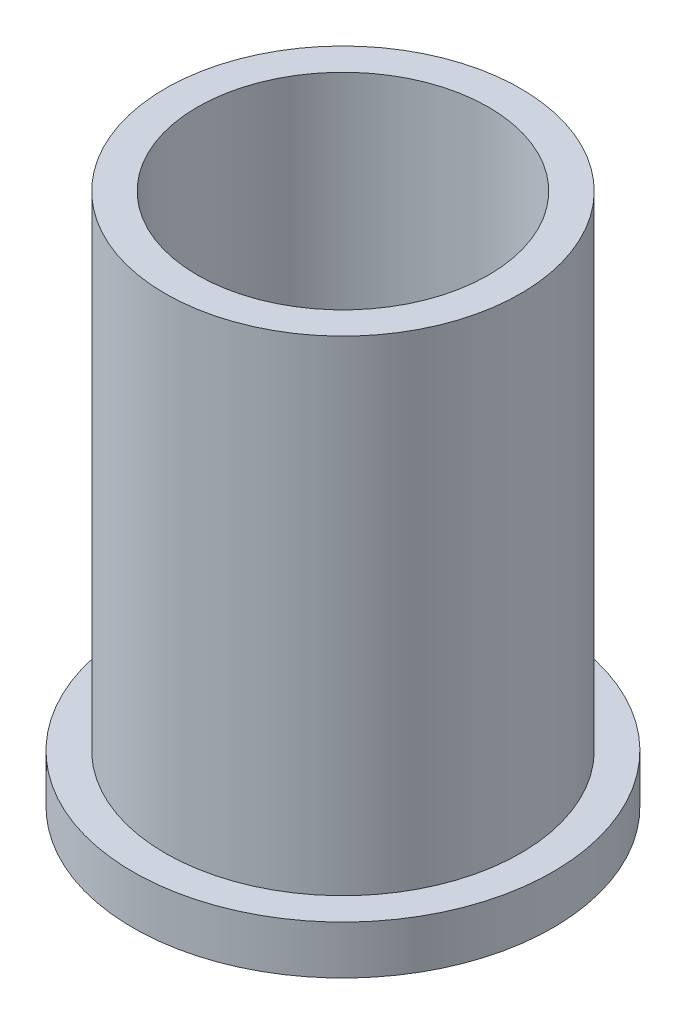
ISO-10303-21;
HEADER;
FILE_DESCRIPTION(('STEP AP214'),'2;1');
FILE_NAME('part.step','',(''),(''),'','','');
FILE_SCHEMA(('AUTOMOTIVE_DESIGN { 1 0 10303 214 1 1 1 1 }'));
ENDSEC;
DATA;
#1=APPLICATION_CONTEXT('core data for automotive mechanical design processes');
#2=APPLICATION_PROTOCOL_DEFINITION('international standard','automotive_design',2000,#1);
#3=PRODUCT_CONTEXT('',#1,'mechanical');
#4=PRODUCT('Part','Part','',(#3));
#5=PRODUCT_RELATED_PRODUCT_CATEGORY('part','',(#4));
#6=PRODUCT_DEFINITION_FORMATION('','',#4);
#7=PRODUCT_DEFINITION_CONTEXT('part definition',#1,'design');
#8=PRODUCT_DEFINITION('design','',#6,#7);
#9=PRODUCT_DEFINITION_SHAPE('','',#8);
#10=(LENGTH_UNIT() NAMED_UNIT(*) SI_UNIT(.MILLI.,.METRE.));
#11=(NAMED_UNIT(*) PLANE_ANGLE_UNIT() SI_UNIT($,.RADIAN.));
#12=(NAMED_UNIT(*) SI_UNIT($,.STERADIAN.) SOLID_ANGLE_UNIT());
#13=UNCERTAINTY_MEASURE_WITH_UNIT(LENGTH_MEASURE(1.E-05),#10,'distance_accuracy_value','');
#14=(GEOMETRIC_REPRESENTATION_CONTEXT(3) GLOBAL_UNCERTAINTY_ASSIGNED_CONTEXT((#13)) GLOBAL_UNIT_ASSIGNED_CONTEXT((#10,
#11,#12)) REPRESENTATION_CONTEXT('',''));
#15=CARTESIAN_POINT('',(0.,0.,0.));
#16=DIRECTION('',(0.,0.,1.));
#17=DIRECTION('',(1.,0.,0.));
#18=AXIS2_PLACEMENT_3D('',#15,#16,#17);
#19=CARTESIAN_POINT('',(0.,150.,0.));
#20=DIRECTION('',(0.,1.,0.));
#21=DIRECTION('',(0.,0.,1.));
#22=AXIS2_PLACEMENT_3D('',#19,#20,#21);
#23=PLANE('',#22);
#24=CARTESIAN_POINT('',(0.,150.,0.));
#25=DIRECTION('',(0.,1.,0.));
#26=DIRECTION('',(0.,0.,1.));
#27=AXIS2_PLACEMENT_3D('',#24,#25,#26);
#28=CIRCLE('',#27,55.);
#29=CARTESIAN_POINT('',(0.,150.,55.));
#30=VERTEX_POINT('',#29);
#31=EDGE_CURVE('E10',#30,#30,#28,.T.);
#32=ORIENTED_EDGE('',*,*,#31,.T.);
#33=EDGE_LOOP('',(#32));
#34=FACE_BOUND('',#33,.T.);
#35=CARTESIAN_POINT('',(0.,150.,0.));
#36=DIRECTION('',(0.,1.,0.));
#37=DIRECTION('',(0.,0.,1.));
#38=AXIS2_PLACEMENT_3D('',#35,#36,#37);
#39=CIRCLE('',#38,45.05);
#40=CARTESIAN_POINT('',(0.,150.,45.05));
#41=VERTEX_POINT('',#40);
#42=EDGE_CURVE('E39',#41,#41,#39,.T.);
#43=ORIENTED_EDGE('',*,*,#42,.F.);
#44=EDGE_LOOP('',(#43));
#45=FACE_BOUND('',#44,.T.);
#46=ADVANCED_FACE('F31',(#34,#45),#23,.T.);
#47=CARTESIAN_POINT('',(0.,150.,0.));
#48=DIRECTION('',(0.,-1.,0.));
#49=DIRECTION('',(0.,0.,-1.));
#50=AXIS2_PLACEMENT_3D('',#47,#48,#49);
#51=CYLINDRICAL_SURFACE('',#50,55.);
#52=ORIENTED_EDGE('',*,*,#31,.F.);
#53=EDGE_LOOP('',(#52));
#54=FACE_BOUND('',#53,.T.);
#55=CARTESIAN_POINT('',(0.,0.,0.));
#56=DIRECTION('',(0.,1.,0.));
#57=DIRECTION('',(0.,0.,1.));
#58=AXIS2_PLACEMENT_3D('',#55,#56,#57);
#59=CIRCLE('',#58,55.);
#60=CARTESIAN_POINT('',(0.,0.,55.));
#61=VERTEX_POINT('',#60);
#62=EDGE_CURVE('E35',#61,#61,#59,.T.);
#63=ORIENTED_EDGE('',*,*,#62,.T.);
#64=EDGE_LOOP('',(#63));
#65=FACE_BOUND('',#64,.T.);
#66=ADVANCED_FACE('F33',(#54,#65),#51,.T.);
#67=CARTESIAN_POINT('',(0.,150.,0.));
#68=DIRECTION('',(0.,-1.,0.));
#69=DIRECTION('',(0.,0.,-1.));
#70=AXIS2_PLACEMENT_3D('',#67,#68,#69);
#71=CYLINDRICAL_SURFACE('',#70,45.05);
#72=ORIENTED_EDGE('',*,*,#42,.T.);
#73=EDGE_LOOP('',(#72));
#74=FACE_BOUND('',#73,.T.);
#75=CARTESIAN_POINT('',(0.,0.,0.));
#76=DIRECTION('',(0.,1.,0.));
#77=DIRECTION('',(0.,0.,1.));
#78=AXIS2_PLACEMENT_3D('',#75,#76,#77);
#79=CIRCLE('',#78,45.05);
#80=CARTESIAN_POINT('',(0.,0.,45.05));
#81=VERTEX_POINT('',#80);
#82=EDGE_CURVE('E43',#81,#81,#79,.T.);
#83=ORIENTED_EDGE('',*,*,#82,.F.);
#84=EDGE_LOOP('',(#83));
#85=FACE_BOUND('',#84,.T.);
#86=ADVANCED_FACE('F76',(#74,#85),#71,.F.);
#87=CARTESIAN_POINT('',(0.,0.,0.));
#88=DIRECTION('',(0.,-1.,0.));
#89=DIRECTION('',(0.,0.,-1.));
#90=AXIS2_PLACEMENT_3D('',#87,#88,#89);
#91=PLANE('',#90);
#92=ORIENTED_EDGE('',*,*,#82,.T.);
#93=EDGE_LOOP('',(#92));
#94=FACE_BOUND('',#93,.T.);
#95=ADVANCED_FACE('F64',(#94),#91,.F.);
#96=CARTESIAN_POINT('',(0.,-15.,0.));
#97=DIRECTION('',(0.,1.,0.));
#98=DIRECTION('',(0.,0.,1.));
#99=AXIS2_PLACEMENT_3D('',#96,#97,#98);
#100=CYLINDRICAL_SURFACE('',#99,65.);
#101=CARTESIAN_POINT('',(0.,-15.,0.));
#102=DIRECTION('',(0.,-1.,0.));
#103=DIRECTION('',(0.,0.,-1.));
#104=AXIS2_PLACEMENT_3D('',#101,#102,#103);
#105=CIRCLE('',#104,65.);
#106=CARTESIAN_POINT('',(0.,-15.,-65.));
#107=VERTEX_POINT('',#106);
#108=EDGE_CURVE('E51',#107,#107,#105,.T.);
#109=ORIENTED_EDGE('',*,*,#108,.F.);
#110=EDGE_LOOP('',(#109));
#111=FACE_BOUND('',#110,.T.);
#112=CARTESIAN_POINT('',(0.,0.,0.));
#113=DIRECTION('',(0.,-1.,0.));
#114=DIRECTION('',(0.,0.,-1.));
#115=AXIS2_PLACEMENT_3D('',#112,#113,#114);
#116=CIRCLE('',#115,65.);
#117=CARTESIAN_POINT('',(0.,0.,-65.));
#118=VERTEX_POINT('',#117);
#119=EDGE_CURVE('E48',#118,#118,#116,.T.);
#120=ORIENTED_EDGE('',*,*,#119,.T.);
#121=EDGE_LOOP('',(#120));
#122=FACE_BOUND('',#121,.T.);
#123=ADVANCED_FACE('F67',(#111,#122),#100,.T.);
#124=CARTESIAN_POINT('',(0.,-15.,0.));
#125=DIRECTION('',(0.,-1.,0.));
#126=DIRECTION('',(0.,0.,-1.));
#127=AXIS2_PLACEMENT_3D('',#124,#125,#126);
#128=PLANE('',#127);
#129=ORIENTED_EDGE('',*,*,#108,.T.);
#130=EDGE_LOOP('',(#129));
#131=FACE_BOUND('',#130,.T.);
#132=ADVANCED_FACE('F62',(#131),#128,.T.);
#133=ORIENTED_EDGE('',*,*,#62,.F.);
#134=EDGE_LOOP('',(#133));
#135=FACE_BOUND('',#134,.T.);
#136=ORIENTED_EDGE('',*,*,#119,.F.);
#137=EDGE_LOOP('',(#136));
#138=FACE_BOUND('',#137,.T.);
#139=ADVANCED_FACE('F59',(#135,#138),#91,.F.);
#140=CLOSED_SHELL('',(#46,#66,#86,#95,#123,#132,#139));
#141=MANIFOLD_SOLID_BREP('B2',#140);
#142=ADVANCED_BREP_SHAPE_REPRESENTATION('',(#18,#141),#14);
#143=SHAPE_DEFINITION_REPRESENTATION(#9,#142);
ENDSEC;
END-ISO-10303-21;
